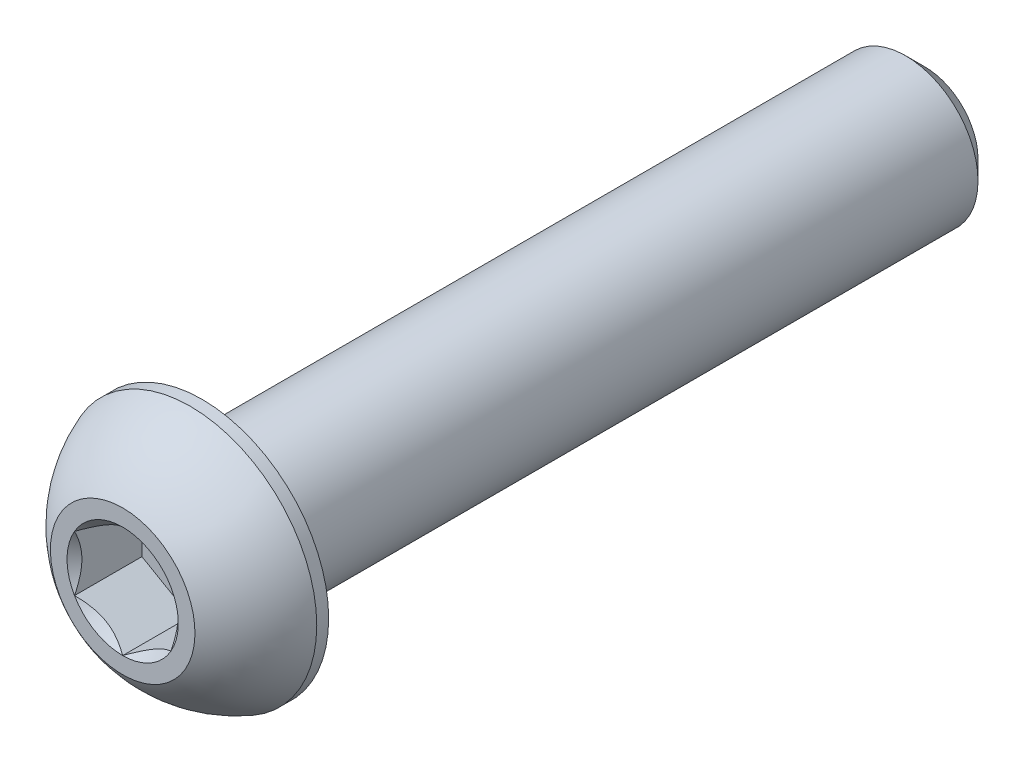
ISO-10303-21;
HEADER;
FILE_DESCRIPTION(('STEP AP214'),'2;1');
FILE_NAME('part.step','',(''),(''),'','','');
FILE_SCHEMA(('AUTOMOTIVE_DESIGN { 1 0 10303 214 1 1 1 1 }'));
ENDSEC;
DATA;
#1=APPLICATION_CONTEXT('core data for automotive mechanical design processes');
#2=APPLICATION_PROTOCOL_DEFINITION('international standard','automotive_design',2000,#1);
#3=PRODUCT_CONTEXT('',#1,'mechanical');
#4=PRODUCT('Part','Part','',(#3));
#5=PRODUCT_RELATED_PRODUCT_CATEGORY('part','',(#4));
#6=PRODUCT_DEFINITION_FORMATION('','',#4);
#7=PRODUCT_DEFINITION_CONTEXT('part definition',#1,'design');
#8=PRODUCT_DEFINITION('design','',#6,#7);
#9=PRODUCT_DEFINITION_SHAPE('','',#8);
#10=(LENGTH_UNIT() NAMED_UNIT(*) SI_UNIT(.MILLI.,.METRE.));
#11=(NAMED_UNIT(*) PLANE_ANGLE_UNIT() SI_UNIT($,.RADIAN.));
#12=(NAMED_UNIT(*) SI_UNIT($,.STERADIAN.) SOLID_ANGLE_UNIT());
#13=UNCERTAINTY_MEASURE_WITH_UNIT(LENGTH_MEASURE(1.E-05),#10,'distance_accuracy_value','');
#14=(GEOMETRIC_REPRESENTATION_CONTEXT(3) GLOBAL_UNCERTAINTY_ASSIGNED_CONTEXT((#13)) GLOBAL_UNIT_ASSIGNED_CONTEXT((#10,
#11,#12)) REPRESENTATION_CONTEXT('',''));
#15=CARTESIAN_POINT('',(0.,0.,0.));
#16=DIRECTION('',(0.,0.,1.));
#17=DIRECTION('',(1.,0.,0.));
#18=AXIS2_PLACEMENT_3D('',#15,#16,#17);
#19=CARTESIAN_POINT('',(0.,0.,16.65));
#20=DIRECTION('',(0.,0.,-1.));
#21=DIRECTION('',(-1.,0.,0.));
#22=AXIS2_PLACEMENT_3D('',#19,#20,#21);
#23=PLANE('',#22);
#24=CARTESIAN_POINT('',(0.,0.,16.65));
#25=DIRECTION('',(0.,0.,1.));
#26=DIRECTION('',(1.,0.,0.));
#27=AXIS2_PLACEMENT_3D('',#24,#25,#26);
#28=CIRCLE('',#27,2.3094010767585);
#29=CARTESIAN_POINT('',(-2.,1.15470053837925,16.65));
#30=VERTEX_POINT('',#29);
#31=CARTESIAN_POINT('',(-2.,-1.15470053837925,16.65));
#32=VERTEX_POINT('',#31);
#33=EDGE_CURVE('E134',#30,#32,#28,.T.);
#34=ORIENTED_EDGE('',*,*,#33,.F.);
#35=CARTESIAN_POINT('',(0.,2.3094010767585,16.65));
#36=VERTEX_POINT('',#35);
#37=EDGE_CURVE('E106',#36,#30,#28,.T.);
#38=ORIENTED_EDGE('',*,*,#37,.F.);
#39=CARTESIAN_POINT('',(2.,1.15470053837925,16.65));
#40=VERTEX_POINT('',#39);
#41=EDGE_CURVE('E97',#40,#36,#28,.T.);
#42=ORIENTED_EDGE('',*,*,#41,.F.);
#43=CARTESIAN_POINT('',(2.,-1.15470053837925,16.65));
#44=VERTEX_POINT('',#43);
#45=EDGE_CURVE('E58',#44,#40,#28,.T.);
#46=ORIENTED_EDGE('',*,*,#45,.F.);
#47=CARTESIAN_POINT('',(0.,-2.3094010767585,16.65));
#48=VERTEX_POINT('',#47);
#49=EDGE_CURVE('E65',#48,#44,#28,.T.);
#50=ORIENTED_EDGE('',*,*,#49,.F.);
#51=EDGE_CURVE('E135',#32,#48,#28,.T.);
#52=ORIENTED_EDGE('',*,*,#51,.F.);
#53=EDGE_LOOP('',(#34,#38,#42,#46,#50,#52));
#54=FACE_BOUND('',#53,.T.);
#55=CARTESIAN_POINT('',(0.,0.,16.65));
#56=DIRECTION('',(0.,0.,1.));
#57=DIRECTION('',(1.,0.,0.));
#58=AXIS2_PLACEMENT_3D('',#55,#56,#57);
#59=CIRCLE('',#58,2.99999999999999);
#60=CARTESIAN_POINT('',(0.,3.,16.65));
#61=VERTEX_POINT('',#60);
#62=EDGE_CURVE('E52',#61,#61,#59,.T.);
#63=ORIENTED_EDGE('',*,*,#62,.T.);
#64=EDGE_LOOP('',(#63));
#65=FACE_BOUND('',#64,.T.);
#66=ADVANCED_FACE('F39',(#54,#65),#23,.F.);
#67=CARTESIAN_POINT('',(0.,0.,11.9386764705882));
#68=DIRECTION('',(0.,0.,1.));
#69=DIRECTION('',(0.,1.,0.));
#70=AXIS2_PLACEMENT_3D('',#67,#68,#69);
#71=SPHERICAL_SURFACE('',#70,5.58538892099637);
#72=CARTESIAN_POINT('',(0.,0.,13.845));
#73=DIRECTION('',(0.,0.,1.));
#74=DIRECTION('',(1.,0.,0.));
#75=AXIS2_PLACEMENT_3D('',#72,#73,#74);
#76=CIRCLE('',#75,5.25);
#77=CARTESIAN_POINT('',(0.,5.25,13.845));
#78=VERTEX_POINT('',#77);
#79=EDGE_CURVE('E217',#78,#78,#76,.T.);
#80=CARTESIAN_POINT('',(0.,3.,16.65));
#81=CARTESIAN_POINT('',(0.,3.03216841047471,16.6295163923313));
#82=CARTESIAN_POINT('',(0.,3.06412696701745,16.608703225294));
#83=CARTESIAN_POINT('',(0.,3.12761110680184,16.5664267201116));
#84=CARTESIAN_POINT('',(0.,3.15913669004349,16.5449633819666));
#85=CARTESIAN_POINT('',(0.,3.22174161778855,16.5013954821982));
#86=CARTESIAN_POINT('',(0.,3.25282096229196,16.4792909205748));
#87=CARTESIAN_POINT('',(0.,3.3145203830256,16.4344498636083));
#88=CARTESIAN_POINT('',(0.,3.34514045925583,16.4117133682651));
#89=CARTESIAN_POINT('',(0.,3.40590849355866,16.3656179791694));
#90=CARTESIAN_POINT('',(0.,3.43605645163126,16.3422590854169));
#91=CARTESIAN_POINT('',(0.,3.49586760131366,16.2949287011981));
#92=CARTESIAN_POINT('',(0.,3.52553079292345,16.2709572107318));
#93=CARTESIAN_POINT('',(0.,3.5843599638299,16.2224116903991));
#94=CARTESIAN_POINT('',(0.,3.61352594312657,16.1978376605326));
#95=CARTESIAN_POINT('',(0.,3.67134845242053,16.1480973718949));
#96=CARTESIAN_POINT('',(0.,3.70000498241782,16.1229311131236));
#97=CARTESIAN_POINT('',(0.,3.75679656980689,16.0720169255492));
#98=CARTESIAN_POINT('',(0.,3.78493162719868,16.0462689967461));
#99=CARTESIAN_POINT('',(0.,3.84066846488056,15.9942022720571));
#100=CARTESIAN_POINT('',(0.,3.86827024517066,15.9678834761712));
#101=CARTESIAN_POINT('',(0.,3.92292894789283,15.9146860597741));
#102=CARTESIAN_POINT('',(0.,3.94998587032491,15.887807439263));
#103=CARTESIAN_POINT('',(0.,4.00354350517958,15.8335016509585));
#104=CARTESIAN_POINT('',(0.,4.03004421760217,15.8060744831651));
#105=CARTESIAN_POINT('',(0.,4.0824783136526,15.7506831077898));
#106=CARTESIAN_POINT('',(0.,4.10841169728044,15.7227189002079));
#107=CARTESIAN_POINT('',(0.,4.1597002549878,15.6662651780729));
#108=CARTESIAN_POINT('',(0.,4.18505542906731,15.6377756635198));
#109=CARTESIAN_POINT('',(0.,4.23517692952119,15.5802832806604));
#110=CARTESIAN_POINT('',(0.,4.25994325589556,15.5512804123541));
#111=CARTESIAN_POINT('',(0.,4.30887666984256,15.4927734905919));
#112=CARTESIAN_POINT('',(0.,4.33304375741518,15.463269437136));
#113=CARTESIAN_POINT('',(0.,4.38076855408201,15.403772523958));
#114=CARTESIAN_POINT('',(0.,4.40432626317621,15.373779664236));
#115=CARTESIAN_POINT('',(0.,4.45082241888372,15.3133177224956));
#116=CARTESIAN_POINT('',(0.,4.47376086549703,15.2828486404772));
#117=CARTESIAN_POINT('',(0.,4.51900887206146,15.2214470379204));
#118=CARTESIAN_POINT('',(0.,4.54131843201258,15.190514517382));
#119=CARTESIAN_POINT('',(0.,4.58529930493053,15.1281990160041));
#120=CARTESIAN_POINT('',(0.,4.60697061789735,15.0968160351647));
#121=CARTESIAN_POINT('',(0.,4.64966590431095,15.0336127804015));
#122=CARTESIAN_POINT('',(0.,4.67068987775773,15.0017925064778));
#123=CARTESIAN_POINT('',(0.,4.71208166419702,14.9377280162358));
#124=CARTESIAN_POINT('',(0.,4.73244947718952,14.9054837999176));
#125=CARTESIAN_POINT('',(0.,4.77252039708775,14.8405849534479));
#126=CARTESIAN_POINT('',(0.,4.79222350399347,14.8079303232964));
#127=CARTESIAN_POINT('',(0.,4.83095674497554,14.7422243499177));
#128=CARTESIAN_POINT('',(0.,4.84998687905189,14.7091730066905));
#129=CARTESIAN_POINT('',(0.,4.8873661899807,14.6426874743619));
#130=CARTESIAN_POINT('',(0.,4.90571536683316,14.6092532852605));
#131=CARTESIAN_POINT('',(0.,4.94172506465618,14.5420160890257));
#132=CARTESIAN_POINT('',(0.,4.95938558562673,14.5082130818924));
#133=CARTESIAN_POINT('',(0.,4.99401056185103,14.4402524321354));
#134=CARTESIAN_POINT('',(0.,5.01097501710478,14.4060947895119));
#135=CARTESIAN_POINT('',(0.,5.04420074452798,14.3374392002723));
#136=CARTESIAN_POINT('',(0.,5.06046201669743,14.3029412536564));
#137=CARTESIAN_POINT('',(0.,5.09227455404011,14.2336195301007));
#138=CARTESIAN_POINT('',(0.,5.10782581921333,14.1987957531609));
#139=CARTESIAN_POINT('',(0.,5.13821182242717,14.1288369816063));
#140=CARTESIAN_POINT('',(0.,5.15304656046779,14.0937019869914));
#141=CARTESIAN_POINT('',(0.,5.18199326796146,14.0231355148288));
#142=CARTESIAN_POINT('',(0.,5.19610523741451,13.9877040372812));
#143=CARTESIAN_POINT('',(0.,5.22360055144049,13.9165594900466));
#144=CARTESIAN_POINT('',(0.,5.23698389601341,13.8808464203597));
#145=CARTESIAN_POINT('',(0.,5.25,13.845));
#146=B_SPLINE_CURVE_WITH_KNOTS('',3,(#80,#81,#82,#83,#84,#85,#86,#87,#88,#89,#90,#91,#92,#93,
#94,#95,#96,#97,#98,#99,#100,#101,#102,#103,#104,#105,#106,#107,#108,#109,#110,#111,#112,#113,
#114,#115,#116,#117,#118,#119,#120,#121,#122,#123,#124,#125,#126,#127,#128,#129,#130,#131,#132,
#133,#134,#135,#136,#137,#138,#139,#140,#141,#142,#143,#144,#145),.UNSPECIFIED.,.F.,.F.,(4,2,2,
2,2,2,2,2,2,2,2,2,2,2,2,2,2,2,2,2,2,2,2,2,2,2,2,2,2,2,2,2,4),(0.,0.114407188898183,
0.228814377796366,0.34322156669455,0.457628755592735,0.572035944490918,0.686443133389102,
0.800850322287285,0.915257511185471,1.02966470008365,1.14407188898184,1.25847907788002,
1.37288626677821,1.48729345567639,1.60170064457457,1.71610783347276,1.83051502237094,
1.94492221126912,2.05932940016731,2.17373658906549,2.28814377796368,2.40255096686186,
2.51695815576004,2.63136534465823,2.74577253355641,2.8601797224546,2.97458691135278,
3.08899410025096,3.20340128914915,3.31780847804733,3.43221566694552,3.5466228558437,
3.66103004474188),.UNSPECIFIED.);
#147=EDGE_CURVE('BSEAM222',#61,#78,#146,.T.);
#148=ORIENTED_EDGE('',*,*,#62,.F.);
#149=ORIENTED_EDGE('',*,*,#79,.T.);
#150=ORIENTED_EDGE('',*,*,#147,.T.);
#151=ORIENTED_EDGE('',*,*,#147,.F.);
#152=EDGE_LOOP('',(#148,#150,#149,#151));
#153=FACE_BOUND('',#152,.T.);
#154=ADVANCED_FACE('F222',(#153),#71,.T.);
#155=CARTESIAN_POINT('',(0.,0.,16.65));
#156=DIRECTION('',(0.,0.,1.));
#157=DIRECTION('',(1.,0.,0.));
#158=AXIS2_PLACEMENT_3D('',#155,#156,#157);
#159=CYLINDRICAL_SURFACE('',#158,5.25);
#160=ORIENTED_EDGE('',*,*,#79,.F.);
#161=EDGE_LOOP('',(#160));
#162=FACE_BOUND('',#161,.T.);
#163=CARTESIAN_POINT('',(0.,0.,13.35));
#164=DIRECTION('',(0.,0.,1.));
#165=DIRECTION('',(1.,0.,0.));
#166=AXIS2_PLACEMENT_3D('',#163,#164,#165);
#167=CIRCLE('',#166,5.25);
#168=CARTESIAN_POINT('',(5.25,0.,13.35));
#169=VERTEX_POINT('',#168);
#170=EDGE_CURVE('E214',#169,#169,#167,.T.);
#171=ORIENTED_EDGE('',*,*,#170,.T.);
#172=EDGE_LOOP('',(#171));
#173=FACE_BOUND('',#172,.T.);
#174=ADVANCED_FACE('F225',(#162,#173),#159,.T.);
#175=CARTESIAN_POINT('',(0.,2.99999999999999,13.35));
#176=DIRECTION('',(0.,0.,1.));
#177=DIRECTION('',(1.,0.,0.));
#178=AXIS2_PLACEMENT_3D('',#175,#176,#177);
#179=PLANE('',#178);
#180=ORIENTED_EDGE('',*,*,#170,.F.);
#181=EDGE_LOOP('',(#180));
#182=FACE_BOUND('',#181,.T.);
#183=CARTESIAN_POINT('',(0.,0.,13.35));
#184=DIRECTION('',(0.,0.,1.));
#185=DIRECTION('',(1.,0.,0.));
#186=AXIS2_PLACEMENT_3D('',#183,#184,#185);
#187=CIRCLE('',#186,2.99999999999999);
#188=CARTESIAN_POINT('',(2.99999999999999,0.,13.35));
#189=VERTEX_POINT('',#188);
#190=EDGE_CURVE('E211',#189,#189,#187,.T.);
#191=ORIENTED_EDGE('',*,*,#190,.T.);
#192=EDGE_LOOP('',(#191));
#193=FACE_BOUND('',#192,.T.);
#194=ADVANCED_FACE('F230',(#182,#193),#179,.F.);
#195=CARTESIAN_POINT('',(0.,0.,16.65));
#196=DIRECTION('',(0.,0.,1.));
#197=DIRECTION('',(1.,0.,0.));
#198=AXIS2_PLACEMENT_3D('',#195,#196,#197);
#199=CYLINDRICAL_SURFACE('',#198,2.99999999999999);
#200=ORIENTED_EDGE('',*,*,#190,.F.);
#201=EDGE_LOOP('',(#200));
#202=FACE_BOUND('',#201,.T.);
#203=CARTESIAN_POINT('',(0.,0.,-15.85));
#204=DIRECTION('',(0.,0.,1.));
#205=DIRECTION('',(1.,0.,0.));
#206=AXIS2_PLACEMENT_3D('',#203,#204,#205);
#207=CIRCLE('',#206,2.99999999999999);
#208=CARTESIAN_POINT('',(2.99999999999999,0.,-15.85));
#209=VERTEX_POINT('',#208);
#210=EDGE_CURVE('E208',#209,#209,#207,.T.);
#211=ORIENTED_EDGE('',*,*,#210,.T.);
#212=EDGE_LOOP('',(#211));
#213=FACE_BOUND('',#212,.T.);
#214=ADVANCED_FACE('F236',(#202,#213),#199,.T.);
#215=CARTESIAN_POINT('',(0.,0.,-16.65));
#216=DIRECTION('',(0.,0.,1.));
#217=DIRECTION('',(1.,0.,0.));
#218=AXIS2_PLACEMENT_3D('',#215,#216,#217);
#219=CONICAL_SURFACE('',#218,2.2,0.785398163397446);
#220=ORIENTED_EDGE('',*,*,#210,.F.);
#221=EDGE_LOOP('',(#220));
#222=FACE_BOUND('',#221,.T.);
#223=CARTESIAN_POINT('',(0.,0.,-16.65));
#224=DIRECTION('',(0.,0.,1.));
#225=DIRECTION('',(1.,0.,0.));
#226=AXIS2_PLACEMENT_3D('',#223,#224,#225);
#227=CIRCLE('',#226,2.2);
#228=CARTESIAN_POINT('',(2.2,0.,-16.65));
#229=VERTEX_POINT('',#228);
#230=EDGE_CURVE('E195',#229,#229,#227,.T.);
#231=ORIENTED_EDGE('',*,*,#230,.T.);
#232=EDGE_LOOP('',(#231));
#233=FACE_BOUND('',#232,.T.);
#234=ADVANCED_FACE('F242',(#222,#233),#219,.T.);
#235=CARTESIAN_POINT('',(0.,0.,-16.65));
#236=DIRECTION('',(0.,0.,1.));
#237=DIRECTION('',(1.,0.,0.));
#238=AXIS2_PLACEMENT_3D('',#235,#236,#237);
#239=PLANE('',#238);
#240=ORIENTED_EDGE('',*,*,#230,.F.);
#241=EDGE_LOOP('',(#240));
#242=FACE_BOUND('',#241,.T.);
#243=ADVANCED_FACE('F168',(#242),#239,.F.);
#244=CARTESIAN_POINT('',(0.,0.,16.65));
#245=DIRECTION('',(0.,0.,1.));
#246=DIRECTION('',(1.,0.,0.));
#247=AXIS2_PLACEMENT_3D('',#244,#245,#246);
#248=CONICAL_SURFACE('',#247,2.3094010767585,0.78539816339745);
#249=ORIENTED_EDGE('',*,*,#37,.T.);
#250=CARTESIAN_POINT('',(0.000199999999999791,2.30951654681234,16.6501154787137));
#251=CARTESIAN_POINT('',(-0.0685530340307059,2.26982196410711,16.6104530902256));
#252=CARTESIAN_POINT('',(-0.138455742135512,2.22946361676572,16.5731199822842));
#253=CARTESIAN_POINT('',(-0.280995244550436,2.1471683966763,16.5047636851361));
#254=CARTESIAN_POINT('',(-0.353645597565358,2.10522369580642,16.4737785337372));
#255=CARTESIAN_POINT('',(-0.500141601053971,2.02064418875706,16.4207002165441));
#256=CARTESIAN_POINT('',(-0.573949935246294,1.97803092714269,16.3984736271766));
#257=CARTESIAN_POINT('',(-0.723191631835263,1.89186619344273,16.3642288166751));
#258=CARTESIAN_POINT('',(-0.79862043391815,1.84831735425552,16.3521850291441));
#259=CARTESIAN_POINT('',(-0.928615500671078,1.7732646674724,16.3413185119056));
#260=CARTESIAN_POINT('',(-0.983013783970107,1.74185780396625,16.33970975361));
#261=CARTESIAN_POINT('',(-1.09172145551969,1.67909540053412,16.3424188775987));
#262=CARTESIAN_POINT('',(-1.14603080592134,1.64773988246022,16.346738837758));
#263=CARTESIAN_POINT('',(-1.25413672758934,1.5853248994842,16.3610595674099));
#264=CARTESIAN_POINT('',(-1.30793265655479,1.55426580541469,16.371066692762));
#265=CARTESIAN_POINT('',(-1.41459426230557,1.49268469862228,16.3962124302497));
#266=CARTESIAN_POINT('',(-1.46746001007071,1.46216264491917,16.4113506490422));
#267=CARTESIAN_POINT('',(-1.60287973308984,1.38397803138049,16.4562945034292));
#268=CARTESIAN_POINT('',(-1.68459383484948,1.33680037273297,16.4894888394258));
#269=CARTESIAN_POINT('',(-1.8047470372578,1.26742988897853,16.5455258231714));
#270=CARTESIAN_POINT('',(-1.84434285210918,1.24456923461531,16.5652147029469));
#271=CARTESIAN_POINT('',(-1.92280095888787,1.19927142554652,16.6063873183649));
#272=CARTESIAN_POINT('',(-1.96166368359374,1.17683402097614,16.6278699516512));
#273=CARTESIAN_POINT('',(-2.0002,1.15458506832541,16.6501154787137));
#274=B_SPLINE_CURVE_WITH_KNOTS('',3,(#250,#251,#252,#253,#254,#255,#256,#257,#258,#259,#260,
#261,#262,#263,#264,#265,#266,#267,#268,#269,#270,#271,#272,#273),.UNSPECIFIED.,.F.,.F.,(4,2,2,
2,2,2,2,2,2,2,2,4),(0.,0.266420613771063,0.534393751523388,0.798110374376913,1.06116288956936,
1.24939906803721,1.43770123566247,1.62621426093931,1.81471283831913,2.11415604834145,
2.26347170717791,2.41269626969771),.UNSPECIFIED.);
#275=EDGE_CURVE('E11',#36,#30,#274,.T.);
#276=ORIENTED_EDGE('',*,*,#275,.F.);
#277=EDGE_LOOP('',(#249,#276));
#278=FACE_BOUND('',#277,.T.);
#279=ADVANCED_FACE('F110',(#278),#248,.F.);
#280=ORIENTED_EDGE('',*,*,#33,.T.);
#281=CARTESIAN_POINT('',(-2.,-2.30294417292923,17.3907713550277));
#282=CARTESIAN_POINT('',(-2.,-2.24687002663712,17.348443273626));
#283=CARTESIAN_POINT('',(-2.,-2.19048190536959,17.3065251568643));
#284=CARTESIAN_POINT('',(-2.,-2.07695390496424,17.223690417861));
#285=CARTESIAN_POINT('',(-2.,-2.01981384066454,17.1827740496681));
#286=CARTESIAN_POINT('',(-2.,-1.90424016804776,17.1018334520186));
#287=CARTESIAN_POINT('',(-2.,-1.8457999674391,17.0618185915599));
#288=CARTESIAN_POINT('',(-2.,-1.7279274546176,16.9832889936643));
#289=CARTESIAN_POINT('',(-2.,-1.66849521292324,16.9447741502431));
#290=CARTESIAN_POINT('',(-2.,-1.4816299571002,16.8276406516043));
#291=CARTESIAN_POINT('',(-2.,-1.35220318163536,16.7521459017296));
#292=CARTESIAN_POINT('',(-2.,-1.08689521592924,16.6140493509944));
#293=CARTESIAN_POINT('',(-2.,-0.95103776393819,16.5514040859035));
#294=CARTESIAN_POINT('',(-2.,-0.747111912259408,16.4747635438751));
#295=CARTESIAN_POINT('',(-2.,-0.682064034147875,16.4527671799191));
#296=CARTESIAN_POINT('',(-2.,-0.550398103294752,16.4139966876601));
#297=CARTESIAN_POINT('',(-2.,-0.483779942722475,16.3972229191212));
#298=CARTESIAN_POINT('',(-2.,-0.350484328847655,16.3700482578844));
#299=CARTESIAN_POINT('',(-2.,-0.283829489364786,16.3595381767417));
#300=CARTESIAN_POINT('',(-2.,-0.149806987139377,16.3450960855449));
#301=CARTESIAN_POINT('',(-2.,-0.0824394489341227,16.3411629447331));
#302=CARTESIAN_POINT('',(-2.,0.0499055622944888,16.3401664769337));
#303=CARTESIAN_POINT('',(-2.,0.114881285143171,16.3428596448504));
#304=CARTESIAN_POINT('',(-2.,0.24427592148276,16.3544300704227));
#305=CARTESIAN_POINT('',(-2.,0.308694780266753,16.3633079288332));
#306=CARTESIAN_POINT('',(-2.,0.437599788610704,16.3869136592961));
#307=CARTESIAN_POINT('',(-2.,0.502067428644594,16.4017410834465));
#308=CARTESIAN_POINT('',(-2.,0.629594322598305,16.436457883628));
#309=CARTESIAN_POINT('',(-2.,0.692653693883149,16.4563468361063));
#310=CARTESIAN_POINT('',(-2.,0.891187889210542,16.5264469792562));
#311=CARTESIAN_POINT('',(-2.,1.02383545707306,16.5846418003215));
#312=CARTESIAN_POINT('',(-2.,1.28290932150074,16.7140305754596));
#313=CARTESIAN_POINT('',(-2.,1.4093111258757,16.7852712314148));
#314=CARTESIAN_POINT('',(-2.,1.59200441438962,16.8964419918747));
#315=CARTESIAN_POINT('',(-2.,1.6502754902619,16.9331821903374));
#316=CARTESIAN_POINT('',(-2.,1.76581760389242,17.0082145141838));
#317=CARTESIAN_POINT('',(-2.,1.82308856543104,17.046506757118));
#318=CARTESIAN_POINT('',(-2.,1.93629654762083,17.1240422640812));
#319=CARTESIAN_POINT('',(-2.,1.99224062500538,17.1632752761336));
#320=CARTESIAN_POINT('',(-2.,2.10336424029899,17.2427788307365));
#321=CARTESIAN_POINT('',(-2.,2.15854398422467,17.2830490850006));
#322=CARTESIAN_POINT('',(-2.,2.21340370692658,17.3237442381459));
#323=B_SPLINE_CURVE_WITH_KNOTS('',3,(#281,#282,#283,#284,#285,#286,#287,#288,#289,#290,#291,
#292,#293,#294,#295,#296,#297,#298,#299,#300,#301,#302,#303,#304,#305,#306,#307,#308,#309,#310,
#311,#312,#313,#314,#315,#316,#317,#318,#319,#320,#321,#322),.UNSPECIFIED.,.F.,.F.,(4,2,2,2,2,2,
2,2,2,2,2,2,2,2,2,2,2,2,2,2,4),(0.,0.210772731976892,0.421598374658588,0.634057554623487,
0.84650169587017,1.29562155455624,1.74319622821645,1.94902062110208,2.15485918928326,
2.35699582502635,2.5590977043214,2.75388435553556,2.94868993014815,3.14690093452586,
3.34509535789702,3.77838155837653,4.21325029921624,4.41989056685646,4.6265465146092,
4.83152377111289,5.03644465914084),.UNSPECIFIED.);
#324=EDGE_CURVE('E105',#30,#32,#323,.F.);
#325=ORIENTED_EDGE('',*,*,#324,.F.);
#326=EDGE_LOOP('',(#280,#325));
#327=FACE_BOUND('',#326,.T.);
#328=ADVANCED_FACE('F255',(#327),#248,.F.);
#329=ORIENTED_EDGE('',*,*,#51,.T.);
#330=CARTESIAN_POINT('',(-2.0002,-1.15458506832541,16.6501154787137));
#331=CARTESIAN_POINT('',(-1.93144696596929,-1.19427965103064,16.6104530902256));
#332=CARTESIAN_POINT('',(-1.86154425786449,-1.23463799837204,16.5731199822842));
#333=CARTESIAN_POINT('',(-1.71900475544956,-1.31693321846145,16.5047636851361));
#334=CARTESIAN_POINT('',(-1.64635440243464,-1.35887791933134,16.4737785337372));
#335=CARTESIAN_POINT('',(-1.49985839894603,-1.44345742638069,16.4207002165441));
#336=CARTESIAN_POINT('',(-1.42605006475371,-1.48607068799507,16.3984736271766));
#337=CARTESIAN_POINT('',(-1.27680836816474,-1.57223542169503,16.3642288166751));
#338=CARTESIAN_POINT('',(-1.20137956608185,-1.61578426088223,16.3521850291441));
#339=CARTESIAN_POINT('',(-1.07138449932892,-1.69083694766536,16.3413185119056));
#340=CARTESIAN_POINT('',(-1.01698621602989,-1.72224381117151,16.33970975361));
#341=CARTESIAN_POINT('',(-0.908278544480309,-1.78500621460364,16.3424188775987));
#342=CARTESIAN_POINT('',(-0.853969194078663,-1.81636173267754,16.346738837758));
#343=CARTESIAN_POINT('',(-0.745863272410664,-1.87877671565355,16.3610595674099));
#344=CARTESIAN_POINT('',(-0.69206734344521,-1.90983580972306,16.371066692762));
#345=CARTESIAN_POINT('',(-0.585405737694428,-1.97141691651547,16.3962124302497));
#346=CARTESIAN_POINT('',(-0.532539989929289,-2.00193897021859,16.4113506490422));
#347=CARTESIAN_POINT('',(-0.397120266910158,-2.08012358375727,16.4562945034292));
#348=CARTESIAN_POINT('',(-0.315406165150523,-2.12730124240478,16.4894888394258));
#349=CARTESIAN_POINT('',(-0.195252962742198,-2.19667172615922,16.5455258231714));
#350=CARTESIAN_POINT('',(-0.155657147890823,-2.21953238052245,16.5652147029469));
#351=CARTESIAN_POINT('',(-0.077199041112127,-2.26483018959124,16.6063873183649));
#352=CARTESIAN_POINT('',(-0.0383363164062592,-2.28726759416161,16.6278699516512));
#353=CARTESIAN_POINT('',(0.00019999999999916,-2.30951654681234,16.6501154787137));
#354=B_SPLINE_CURVE_WITH_KNOTS('',3,(#330,#331,#332,#333,#334,#335,#336,#337,#338,#339,#340,
#341,#342,#343,#344,#345,#346,#347,#348,#349,#350,#351,#352,#353),.UNSPECIFIED.,.F.,.F.,(4,2,2,
2,2,2,2,2,2,2,2,4),(0.,0.266420613771064,0.534393751523389,0.798110374376913,1.06116288956936,
1.24939906803722,1.43770123566247,1.62621426093932,1.81471283831913,2.11415604834145,
2.26347170717791,2.41269626969771),.UNSPECIFIED.);
#355=EDGE_CURVE('E144',#32,#48,#354,.T.);
#356=ORIENTED_EDGE('',*,*,#355,.F.);
#357=EDGE_LOOP('',(#329,#356));
#358=FACE_BOUND('',#357,.T.);
#359=ADVANCED_FACE('F272',(#358),#248,.F.);
#360=ORIENTED_EDGE('',*,*,#49,.T.);
#361=CARTESIAN_POINT('',(-0.000200000000000681,-2.30951654681234,16.6501154787137));
#362=CARTESIAN_POINT('',(0.0685530340307052,-2.26982196410711,16.6104530902256));
#363=CARTESIAN_POINT('',(0.138455742135511,-2.22946361676572,16.5731199822842));
#364=CARTESIAN_POINT('',(0.280995244550436,-2.1471683966763,16.5047636851361));
#365=CARTESIAN_POINT('',(0.353645597565357,-2.10522369580642,16.4737785337372));
#366=CARTESIAN_POINT('',(0.50014160105397,-2.02064418875706,16.4207002165441));
#367=CARTESIAN_POINT('',(0.573949935246293,-1.97803092714269,16.3984736271766));
#368=CARTESIAN_POINT('',(0.723191631835263,-1.89186619344273,16.3642288166751));
#369=CARTESIAN_POINT('',(0.79862043391815,-1.84831735425552,16.3521850291441));
#370=CARTESIAN_POINT('',(0.928615500671077,-1.7732646674724,16.3413185119056));
#371=CARTESIAN_POINT('',(0.983013783970107,-1.74185780396625,16.33970975361));
#372=CARTESIAN_POINT('',(1.09172145551969,-1.67909540053412,16.3424188775987));
#373=CARTESIAN_POINT('',(1.14603080592134,-1.64773988246022,16.346738837758));
#374=CARTESIAN_POINT('',(1.25413672758934,-1.5853248994842,16.3610595674099));
#375=CARTESIAN_POINT('',(1.30793265655479,-1.55426580541469,16.371066692762));
#376=CARTESIAN_POINT('',(1.41459426230557,-1.49268469862228,16.3962124302497));
#377=CARTESIAN_POINT('',(1.46746001007071,-1.46216264491917,16.4113506490422));
#378=CARTESIAN_POINT('',(1.60287973308984,-1.38397803138049,16.4562945034292));
#379=CARTESIAN_POINT('',(1.68459383484948,-1.33680037273297,16.4894888394258));
#380=CARTESIAN_POINT('',(1.8047470372578,-1.26742988897853,16.5455258231714));
#381=CARTESIAN_POINT('',(1.84434285210918,-1.24456923461531,16.5652147029469));
#382=CARTESIAN_POINT('',(1.92280095888787,-1.19927142554652,16.6063873183649));
#383=CARTESIAN_POINT('',(1.96166368359374,-1.17683402097614,16.6278699516512));
#384=CARTESIAN_POINT('',(2.0002,-1.15458506832541,16.6501154787137));
#385=B_SPLINE_CURVE_WITH_KNOTS('',3,(#361,#362,#363,#364,#365,#366,#367,#368,#369,#370,#371,
#372,#373,#374,#375,#376,#377,#378,#379,#380,#381,#382,#383,#384),.UNSPECIFIED.,.F.,.F.,(4,2,2,
2,2,2,2,2,2,2,2,4),(0.,0.266420613771063,0.534393751523389,0.798110374376914,1.06116288956936,
1.24939906803722,1.43770123566247,1.62621426093932,1.81471283831913,2.11415604834145,
2.26347170717791,2.41269626969771),.UNSPECIFIED.);
#386=EDGE_CURVE('E352',#48,#44,#385,.T.);
#387=ORIENTED_EDGE('',*,*,#386,.F.);
#388=EDGE_LOOP('',(#360,#387));
#389=FACE_BOUND('',#388,.T.);
#390=ADVANCED_FACE('F279',(#389),#248,.F.);
#391=ORIENTED_EDGE('',*,*,#45,.T.);
#392=CARTESIAN_POINT('',(2.,-2.30294417292924,17.3907713550277));
#393=CARTESIAN_POINT('',(2.,-2.24687002663712,17.348443273626));
#394=CARTESIAN_POINT('',(2.,-2.19048190536959,17.3065251568643));
#395=CARTESIAN_POINT('',(2.,-2.07695390496424,17.223690417861));
#396=CARTESIAN_POINT('',(2.,-2.01981384066454,17.1827740496681));
#397=CARTESIAN_POINT('',(2.,-1.90424016804776,17.1018334520186));
#398=CARTESIAN_POINT('',(2.,-1.8457999674391,17.0618185915599));
#399=CARTESIAN_POINT('',(2.,-1.72792745461761,16.9832889936643));
#400=CARTESIAN_POINT('',(2.,-1.66849521292324,16.9447741502431));
#401=CARTESIAN_POINT('',(2.,-1.4816299571002,16.8276406516043));
#402=CARTESIAN_POINT('',(2.,-1.35220318163536,16.7521459017296));
#403=CARTESIAN_POINT('',(2.,-1.08689521592924,16.6140493509944));
#404=CARTESIAN_POINT('',(2.,-0.951037763938191,16.5514040859035));
#405=CARTESIAN_POINT('',(2.,-0.747111912259409,16.4747635438751));
#406=CARTESIAN_POINT('',(2.,-0.682064034147876,16.4527671799191));
#407=CARTESIAN_POINT('',(2.,-0.550398103294752,16.4139966876601));
#408=CARTESIAN_POINT('',(2.,-0.483779942722476,16.3972229191212));
#409=CARTESIAN_POINT('',(2.,-0.350484328847655,16.3700482578844));
#410=CARTESIAN_POINT('',(2.,-0.283829489364787,16.3595381767417));
#411=CARTESIAN_POINT('',(2.,-0.149806987139378,16.3450960855449));
#412=CARTESIAN_POINT('',(2.,-0.0824394489341235,16.3411629447331));
#413=CARTESIAN_POINT('',(2.,0.0499055622944882,16.3401664769337));
#414=CARTESIAN_POINT('',(2.,0.114881285143171,16.3428596448504));
#415=CARTESIAN_POINT('',(2.,0.244275921482759,16.3544300704227));
#416=CARTESIAN_POINT('',(2.,0.308694780266752,16.3633079288332));
#417=CARTESIAN_POINT('',(2.,0.437599788610704,16.3869136592961));
#418=CARTESIAN_POINT('',(2.,0.502067428644594,16.4017410834465));
#419=CARTESIAN_POINT('',(2.,0.629594322598305,16.436457883628));
#420=CARTESIAN_POINT('',(2.,0.692653693883149,16.4563468361063));
#421=CARTESIAN_POINT('',(2.,0.891187889210542,16.5264469792562));
#422=CARTESIAN_POINT('',(2.,1.02383545707306,16.5846418003215));
#423=CARTESIAN_POINT('',(2.,1.28290932150074,16.7140305754596));
#424=CARTESIAN_POINT('',(2.,1.4093111258757,16.7852712314148));
#425=CARTESIAN_POINT('',(2.,1.59200441438962,16.8964419918747));
#426=CARTESIAN_POINT('',(2.,1.6502754902619,16.9331821903374));
#427=CARTESIAN_POINT('',(2.,1.76581760389242,17.0082145141838));
#428=CARTESIAN_POINT('',(2.,1.82308856543104,17.046506757118));
#429=CARTESIAN_POINT('',(2.,1.93629654762083,17.1240422640812));
#430=CARTESIAN_POINT('',(2.,1.99224062500538,17.1632752761336));
#431=CARTESIAN_POINT('',(2.,2.10336424029899,17.2427788307365));
#432=CARTESIAN_POINT('',(2.,2.15854398422468,17.2830490850006));
#433=CARTESIAN_POINT('',(2.,2.21340370692658,17.3237442381459));
#434=B_SPLINE_CURVE_WITH_KNOTS('',3,(#392,#393,#394,#395,#396,#397,#398,#399,#400,#401,#402,
#403,#404,#405,#406,#407,#408,#409,#410,#411,#412,#413,#414,#415,#416,#417,#418,#419,#420,#421,
#422,#423,#424,#425,#426,#427,#428,#429,#430,#431,#432,#433),.UNSPECIFIED.,.F.,.F.,(4,2,2,2,2,2,
2,2,2,2,2,2,2,2,2,2,2,2,2,2,4),(0.,0.210772731976893,0.421598374658589,0.634057554623488,
0.846501695870171,1.29562155455624,1.74319622821645,1.94902062110208,2.15485918928326,
2.35699582502635,2.5590977043214,2.75388435553556,2.94868993014815,3.14690093452586,
3.34509535789702,3.77838155837654,4.21325029921625,4.41989056685646,4.62654651460921,
4.83152377111289,5.03644465914085),.UNSPECIFIED.);
#435=EDGE_CURVE('E122',#44,#40,#434,.T.);
#436=ORIENTED_EDGE('',*,*,#435,.F.);
#437=EDGE_LOOP('',(#391,#436));
#438=FACE_BOUND('',#437,.T.);
#439=ADVANCED_FACE('F286',(#438),#248,.F.);
#440=ORIENTED_EDGE('',*,*,#41,.T.);
#441=CARTESIAN_POINT('',(2.0002,1.15458506832541,16.6501154787137));
#442=CARTESIAN_POINT('',(1.93144696596929,1.19427965103064,16.6104530902256));
#443=CARTESIAN_POINT('',(1.86154425786449,1.23463799837204,16.5731199822842));
#444=CARTESIAN_POINT('',(1.71900475544956,1.31693321846145,16.5047636851361));
#445=CARTESIAN_POINT('',(1.64635440243464,1.35887791933134,16.4737785337372));
#446=CARTESIAN_POINT('',(1.49985839894603,1.44345742638069,16.4207002165441));
#447=CARTESIAN_POINT('',(1.42605006475371,1.48607068799507,16.3984736271766));
#448=CARTESIAN_POINT('',(1.27680836816474,1.57223542169503,16.3642288166751));
#449=CARTESIAN_POINT('',(1.20137956608185,1.61578426088223,16.3521850291441));
#450=CARTESIAN_POINT('',(1.07138449932892,1.69083694766536,16.3413185119056));
#451=CARTESIAN_POINT('',(1.01698621602989,1.72224381117151,16.33970975361));
#452=CARTESIAN_POINT('',(0.908278544480308,1.78500621460364,16.3424188775987));
#453=CARTESIAN_POINT('',(0.853969194078662,1.81636173267754,16.346738837758));
#454=CARTESIAN_POINT('',(0.745863272410663,1.87877671565355,16.3610595674099));
#455=CARTESIAN_POINT('',(0.692067343445209,1.90983580972306,16.371066692762));
#456=CARTESIAN_POINT('',(0.585405737694427,1.97141691651547,16.3962124302497));
#457=CARTESIAN_POINT('',(0.532539989929288,2.00193897021859,16.4113506490422));
#458=CARTESIAN_POINT('',(0.397120266910157,2.08012358375727,16.4562945034292));
#459=CARTESIAN_POINT('',(0.315406165150523,2.12730124240478,16.4894888394258));
#460=CARTESIAN_POINT('',(0.195252962742198,2.19667172615922,16.5455258231714));
#461=CARTESIAN_POINT('',(0.155657147890822,2.21953238052245,16.5652147029469));
#462=CARTESIAN_POINT('',(0.0771990411121265,2.26483018959124,16.6063873183649));
#463=CARTESIAN_POINT('',(0.0383363164062587,2.28726759416161,16.6278699516512));
#464=CARTESIAN_POINT('',(-0.000199999999999877,2.30951654681234,16.6501154787137));
#465=B_SPLINE_CURVE_WITH_KNOTS('',3,(#441,#442,#443,#444,#445,#446,#447,#448,#449,#450,#451,
#452,#453,#454,#455,#456,#457,#458,#459,#460,#461,#462,#463,#464),.UNSPECIFIED.,.F.,.F.,(4,2,2,
2,2,2,2,2,2,2,2,4),(0.,0.266420613771063,0.534393751523389,0.798110374376913,1.06116288956936,
1.24939906803722,1.43770123566247,1.62621426093932,1.81471283831913,2.11415604834145,
2.26347170717791,2.41269626969771),.UNSPECIFIED.);
#466=EDGE_CURVE('E101',#40,#36,#465,.T.);
#467=ORIENTED_EDGE('',*,*,#466,.F.);
#468=EDGE_LOOP('',(#440,#467));
#469=FACE_BOUND('',#468,.T.);
#470=ADVANCED_FACE('F99',(#469),#248,.F.);
#471=CARTESIAN_POINT('',(0.,0.,13.85));
#472=DIRECTION('',(0.,0.,1.));
#473=DIRECTION('',(1.,0.,0.));
#474=AXIS2_PLACEMENT_3D('',#471,#472,#473);
#475=PLANE('',#474);
#476=DIRECTION('',(-0.866025403784438,0.5,0.));
#477=VECTOR('',#476,1.);
#478=CARTESIAN_POINT('',(2.,1.15470053837925,13.85));
#479=LINE('',#478,#477);
#480=CARTESIAN_POINT('',(2.,1.15470053837925,13.85));
#481=VERTEX_POINT('',#480);
#482=CARTESIAN_POINT('',(0.,2.3094010767585,13.85));
#483=VERTEX_POINT('',#482);
#484=EDGE_CURVE('E121',#481,#483,#479,.T.);
#485=ORIENTED_EDGE('',*,*,#484,.T.);
#486=DIRECTION('',(-0.866025403784439,-0.5,0.));
#487=VECTOR('',#486,1.);
#488=CARTESIAN_POINT('',(0.,2.3094010767585,13.85));
#489=LINE('',#488,#487);
#490=CARTESIAN_POINT('',(-2.,1.15470053837925,13.85));
#491=VERTEX_POINT('',#490);
#492=EDGE_CURVE('E126',#483,#491,#489,.T.);
#493=ORIENTED_EDGE('',*,*,#492,.T.);
#494=DIRECTION('',(0.,-1.,0.));
#495=VECTOR('',#494,1.);
#496=CARTESIAN_POINT('',(-2.,1.15470053837925,13.85));
#497=LINE('',#496,#495);
#498=CARTESIAN_POINT('',(-2.,-1.15470053837925,13.85));
#499=VERTEX_POINT('',#498);
#500=EDGE_CURVE('E183',#491,#499,#497,.T.);
#501=ORIENTED_EDGE('',*,*,#500,.T.);
#502=DIRECTION('',(0.866025403784439,-0.5,0.));
#503=VECTOR('',#502,1.);
#504=CARTESIAN_POINT('',(-2.,-1.15470053837925,13.85));
#505=LINE('',#504,#503);
#506=CARTESIAN_POINT('',(0.,-2.3094010767585,13.85));
#507=VERTEX_POINT('',#506);
#508=EDGE_CURVE('E186',#499,#507,#505,.T.);
#509=ORIENTED_EDGE('',*,*,#508,.T.);
#510=DIRECTION('',(0.866025403784439,0.5,0.));
#511=VECTOR('',#510,1.);
#512=CARTESIAN_POINT('',(0.,-2.3094010767585,13.85));
#513=LINE('',#512,#511);
#514=CARTESIAN_POINT('',(2.,-1.15470053837925,13.85));
#515=VERTEX_POINT('',#514);
#516=EDGE_CURVE('E189',#507,#515,#513,.T.);
#517=ORIENTED_EDGE('',*,*,#516,.T.);
#518=DIRECTION('',(0.,1.,0.));
#519=VECTOR('',#518,1.);
#520=CARTESIAN_POINT('',(2.,-1.15470053837925,13.85));
#521=LINE('',#520,#519);
#522=EDGE_CURVE('E129',#515,#481,#521,.T.);
#523=ORIENTED_EDGE('',*,*,#522,.T.);
#524=EDGE_LOOP('',(#485,#493,#501,#509,#517,#523));
#525=FACE_BOUND('',#524,.T.);
#526=ADVANCED_FACE('F163',(#525),#475,.T.);
#527=CARTESIAN_POINT('',(0.,2.3094010767585,13.85));
#528=DIRECTION('',(-0.5,0.866025403784439,0.));
#529=DIRECTION('',(-0.866025403784439,-0.5,0.));
#530=AXIS2_PLACEMENT_3D('',#527,#528,#529);
#531=PLANE('',#530);
#532=DIRECTION('',(0.,0.,1.));
#533=VECTOR('',#532,1.);
#534=CARTESIAN_POINT('',(0.,2.3094010767585,13.85));
#535=LINE('',#534,#533);
#536=EDGE_CURVE('E118',#483,#36,#535,.T.);
#537=ORIENTED_EDGE('',*,*,#536,.T.);
#538=ORIENTED_EDGE('',*,*,#275,.T.);
#539=DIRECTION('',(0.,0.,1.));
#540=VECTOR('',#539,1.);
#541=CARTESIAN_POINT('',(-2.,1.15470053837925,13.85));
#542=LINE('',#541,#540);
#543=EDGE_CURVE('E128',#491,#30,#542,.T.);
#544=ORIENTED_EDGE('',*,*,#543,.F.);
#545=ORIENTED_EDGE('',*,*,#492,.F.);
#546=EDGE_LOOP('',(#537,#538,#544,#545));
#547=FACE_BOUND('',#546,.T.);
#548=ADVANCED_FACE('F124',(#547),#531,.F.);
#549=CARTESIAN_POINT('',(-2.,1.15470053837925,13.85));
#550=DIRECTION('',(-1.,0.,0.));
#551=DIRECTION('',(0.,0.,1.));
#552=AXIS2_PLACEMENT_3D('',#549,#550,#551);
#553=PLANE('',#552);
#554=ORIENTED_EDGE('',*,*,#543,.T.);
#555=ORIENTED_EDGE('',*,*,#324,.T.);
#556=DIRECTION('',(0.,0.,1.));
#557=VECTOR('',#556,1.);
#558=CARTESIAN_POINT('',(-2.,-1.15470053837925,13.85));
#559=LINE('',#558,#557);
#560=EDGE_CURVE('E202',#499,#32,#559,.T.);
#561=ORIENTED_EDGE('',*,*,#560,.F.);
#562=ORIENTED_EDGE('',*,*,#500,.F.);
#563=EDGE_LOOP('',(#554,#555,#561,#562));
#564=FACE_BOUND('',#563,.T.);
#565=ADVANCED_FACE('F153',(#564),#553,.F.);
#566=CARTESIAN_POINT('',(-2.,-1.15470053837925,13.85));
#567=DIRECTION('',(-0.5,-0.866025403784439,0.));
#568=DIRECTION('',(0.866025403784438,-0.5,0.));
#569=AXIS2_PLACEMENT_3D('',#566,#567,#568);
#570=PLANE('',#569);
#571=ORIENTED_EDGE('',*,*,#560,.T.);
#572=ORIENTED_EDGE('',*,*,#355,.T.);
#573=DIRECTION('',(0.,0.,1.));
#574=VECTOR('',#573,1.);
#575=CARTESIAN_POINT('',(0.,-2.3094010767585,13.85));
#576=LINE('',#575,#574);
#577=EDGE_CURVE('E199',#507,#48,#576,.T.);
#578=ORIENTED_EDGE('',*,*,#577,.F.);
#579=ORIENTED_EDGE('',*,*,#508,.F.);
#580=EDGE_LOOP('',(#571,#572,#578,#579));
#581=FACE_BOUND('',#580,.T.);
#582=ADVANCED_FACE('F156',(#581),#570,.F.);
#583=CARTESIAN_POINT('',(0.,-2.3094010767585,13.85));
#584=DIRECTION('',(0.5,-0.866025403784439,0.));
#585=DIRECTION('',(0.866025403784439,0.5,0.));
#586=AXIS2_PLACEMENT_3D('',#583,#584,#585);
#587=PLANE('',#586);
#588=ORIENTED_EDGE('',*,*,#577,.T.);
#589=ORIENTED_EDGE('',*,*,#386,.T.);
#590=DIRECTION('',(0.,0.,1.));
#591=VECTOR('',#590,1.);
#592=CARTESIAN_POINT('',(2.,-1.15470053837925,13.85));
#593=LINE('',#592,#591);
#594=EDGE_CURVE('E196',#515,#44,#593,.T.);
#595=ORIENTED_EDGE('',*,*,#594,.F.);
#596=ORIENTED_EDGE('',*,*,#516,.F.);
#597=EDGE_LOOP('',(#588,#589,#595,#596));
#598=FACE_BOUND('',#597,.T.);
#599=ADVANCED_FACE('F310',(#598),#587,.F.);
#600=CARTESIAN_POINT('',(2.,-1.15470053837925,13.85));
#601=DIRECTION('',(1.,0.,0.));
#602=DIRECTION('',(0.,0.,-1.));
#603=AXIS2_PLACEMENT_3D('',#600,#601,#602);
#604=PLANE('',#603);
#605=ORIENTED_EDGE('',*,*,#594,.T.);
#606=ORIENTED_EDGE('',*,*,#435,.T.);
#607=DIRECTION('',(0.,0.,1.));
#608=VECTOR('',#607,1.);
#609=CARTESIAN_POINT('',(2.,1.15470053837925,13.85));
#610=LINE('',#609,#608);
#611=EDGE_CURVE('E120',#481,#40,#610,.T.);
#612=ORIENTED_EDGE('',*,*,#611,.F.);
#613=ORIENTED_EDGE('',*,*,#522,.F.);
#614=EDGE_LOOP('',(#605,#606,#612,#613));
#615=FACE_BOUND('',#614,.T.);
#616=ADVANCED_FACE('F167',(#615),#604,.F.);
#617=CARTESIAN_POINT('',(2.,1.15470053837925,13.85));
#618=DIRECTION('',(0.5,0.866025403784438,0.));
#619=DIRECTION('',(-0.866025403784439,0.5,0.));
#620=AXIS2_PLACEMENT_3D('',#617,#618,#619);
#621=PLANE('',#620);
#622=ORIENTED_EDGE('',*,*,#611,.T.);
#623=ORIENTED_EDGE('',*,*,#466,.T.);
#624=ORIENTED_EDGE('',*,*,#536,.F.);
#625=ORIENTED_EDGE('',*,*,#484,.F.);
#626=EDGE_LOOP('',(#622,#623,#624,#625));
#627=FACE_BOUND('',#626,.T.);
#628=ADVANCED_FACE('F116',(#627),#621,.F.);
#629=CLOSED_SHELL('',(#66,#154,#174,#194,#214,#234,#243,#279,#328,#359,#390,#439,#470,#526,#548,
#565,#582,#599,#616,#628));
#630=MANIFOLD_SOLID_BREP('B2',#629);
#631=ADVANCED_BREP_SHAPE_REPRESENTATION('',(#18,#630),#14);
#632=SHAPE_DEFINITION_REPRESENTATION(#9,#631);
ENDSEC;
END-ISO-10303-21;
